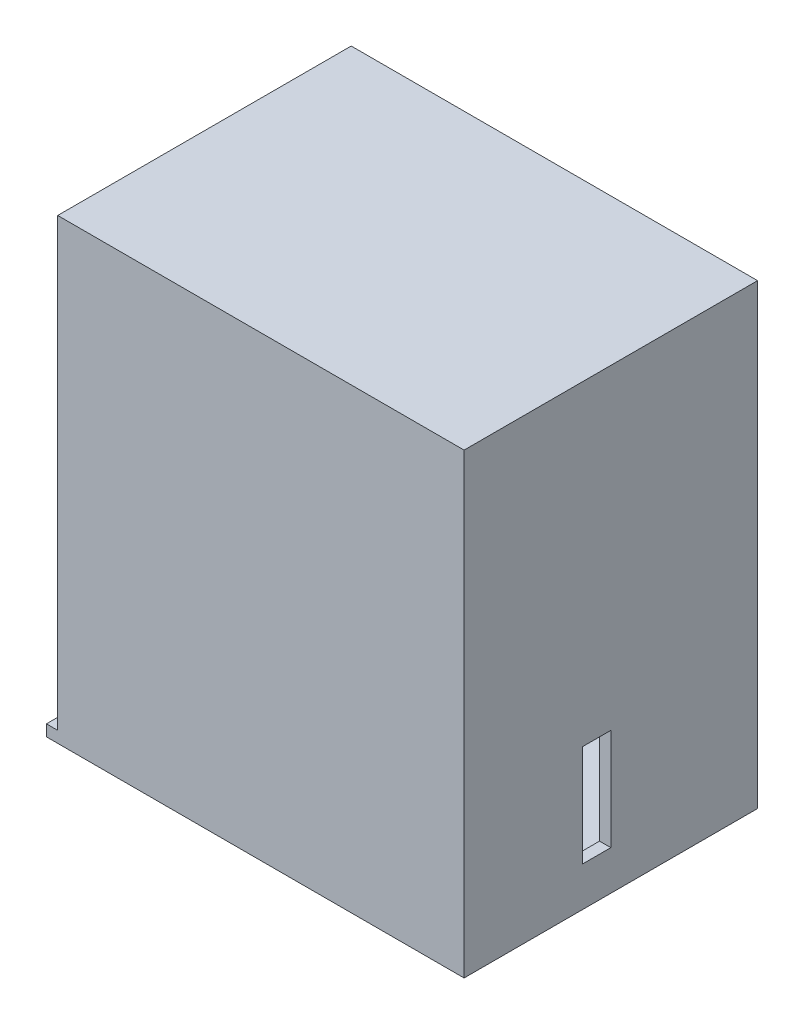
ISO-10303-21;
HEADER;
FILE_DESCRIPTION(('STEP AP214'),'2;1');
FILE_NAME('part.step','',(''),(''),'','','');
FILE_SCHEMA(('AUTOMOTIVE_DESIGN { 1 0 10303 214 1 1 1 1 }'));
ENDSEC;
DATA;
#1=APPLICATION_CONTEXT('core data for automotive mechanical design processes');
#2=APPLICATION_PROTOCOL_DEFINITION('international standard','automotive_design',2000,#1);
#3=PRODUCT_CONTEXT('',#1,'mechanical');
#4=PRODUCT('Part','Part','',(#3));
#5=PRODUCT_RELATED_PRODUCT_CATEGORY('part','',(#4));
#6=PRODUCT_DEFINITION_FORMATION('','',#4);
#7=PRODUCT_DEFINITION_CONTEXT('part definition',#1,'design');
#8=PRODUCT_DEFINITION('design','',#6,#7);
#9=PRODUCT_DEFINITION_SHAPE('','',#8);
#10=(LENGTH_UNIT() NAMED_UNIT(*) SI_UNIT(.MILLI.,.METRE.));
#11=(NAMED_UNIT(*) PLANE_ANGLE_UNIT() SI_UNIT($,.RADIAN.));
#12=(NAMED_UNIT(*) SI_UNIT($,.STERADIAN.) SOLID_ANGLE_UNIT());
#13=UNCERTAINTY_MEASURE_WITH_UNIT(LENGTH_MEASURE(1.E-05),#10,'distance_accuracy_value','');
#14=(GEOMETRIC_REPRESENTATION_CONTEXT(3) GLOBAL_UNCERTAINTY_ASSIGNED_CONTEXT((#13)) GLOBAL_UNIT_ASSIGNED_CONTEXT((#10,
#11,#12)) REPRESENTATION_CONTEXT('',''));
#15=CARTESIAN_POINT('',(0.,0.,0.));
#16=DIRECTION('',(0.,0.,1.));
#17=DIRECTION('',(1.,0.,0.));
#18=AXIS2_PLACEMENT_3D('',#15,#16,#17);
#19=CARTESIAN_POINT('',(-79.4466637243918,4.20962199312715,2.));
#20=DIRECTION('',(1.,0.,0.));
#21=DIRECTION('',(0.,1.,0.));
#22=AXIS2_PLACEMENT_3D('',#19,#20,#21);
#23=PLANE('',#22);
#24=DIRECTION('',(0.,-1.,0.));
#25=VECTOR('',#24,1.);
#26=CARTESIAN_POINT('',(-79.4466637243918,4.20962199312715,0.));
#27=LINE('',#26,#25);
#28=CARTESIAN_POINT('',(-79.4466637243918,4.20962199312715,0.));
#29=VERTEX_POINT('',#28);
#30=CARTESIAN_POINT('',(-79.4466637243918,-72.7903780068729,0.));
#31=VERTEX_POINT('',#30);
#32=EDGE_CURVE('E59',#29,#31,#27,.T.);
#33=ORIENTED_EDGE('',*,*,#32,.T.);
#34=DIRECTION('',(0.,0.,-1.));
#35=VECTOR('',#34,1.);
#36=CARTESIAN_POINT('',(-79.4466637243918,-72.7903780068729,2.));
#37=LINE('',#36,#35);
#38=CARTESIAN_POINT('',(-79.4466637243918,-72.7903780068729,2.));
#39=VERTEX_POINT('',#38);
#40=EDGE_CURVE('E11',#39,#31,#37,.T.);
#41=ORIENTED_EDGE('',*,*,#40,.F.);
#42=DIRECTION('',(0.,-1.,0.));
#43=VECTOR('',#42,1.);
#44=CARTESIAN_POINT('',(-79.4466637243918,4.20962199312715,2.));
#45=LINE('',#44,#43);
#46=CARTESIAN_POINT('',(-79.4466637243918,6.20962199312715,2.));
#47=VERTEX_POINT('',#46);
#48=EDGE_CURVE('E41',#47,#39,#45,.T.);
#49=ORIENTED_EDGE('',*,*,#48,.F.);
#50=DIRECTION('',(0.,0.,1.));
#51=VECTOR('',#50,1.);
#52=CARTESIAN_POINT('',(-79.4466637243918,6.20962199312715,2.));
#53=LINE('',#52,#51);
#54=CARTESIAN_POINT('',(-79.4466637243918,6.20962199312715,-50.));
#55=VERTEX_POINT('',#54);
#56=EDGE_CURVE('E162',#55,#47,#53,.T.);
#57=ORIENTED_EDGE('',*,*,#56,.F.);
#58=DIRECTION('',(0.,-1.,0.));
#59=VECTOR('',#58,1.);
#60=CARTESIAN_POINT('',(-79.4466637243918,6.20962199312715,-50.));
#61=LINE('',#60,#59);
#62=CARTESIAN_POINT('',(-79.4466637243918,4.20962199312715,-50.));
#63=VERTEX_POINT('',#62);
#64=EDGE_CURVE('E187',#55,#63,#61,.T.);
#65=ORIENTED_EDGE('',*,*,#64,.T.);
#66=DIRECTION('',(0.,0.,1.));
#67=VECTOR('',#66,1.);
#68=CARTESIAN_POINT('',(-79.4466637243918,4.20962199312715,2.));
#69=LINE('',#68,#67);
#70=EDGE_CURVE('E182',#63,#29,#69,.T.);
#71=ORIENTED_EDGE('',*,*,#70,.T.);
#72=EDGE_LOOP('',(#33,#41,#49,#57,#65,#71));
#73=FACE_BOUND('',#72,.T.);
#74=ADVANCED_FACE('F33',(#73),#23,.F.);
#75=CARTESIAN_POINT('',(0.,0.,2.));
#76=DIRECTION('',(0.,0.,-1.));
#77=DIRECTION('',(-1.,0.,0.));
#78=AXIS2_PLACEMENT_3D('',#75,#76,#77);
#79=PLANE('',#78);
#80=ORIENTED_EDGE('',*,*,#48,.T.);
#81=DIRECTION('',(-1.,0.,0.));
#82=VECTOR('',#81,1.);
#83=CARTESIAN_POINT('',(-7.4466637243918,-72.7903780068729,2.));
#84=LINE('',#83,#82);
#85=CARTESIAN_POINT('',(-81.4466637243918,-72.7903780068729,1.99999999999999));
#86=VERTEX_POINT('',#85);
#87=EDGE_CURVE('E222',#39,#86,#84,.T.);
#88=ORIENTED_EDGE('',*,*,#87,.T.);
#89=DIRECTION('',(0.,1.,0.));
#90=VECTOR('',#89,1.);
#91=CARTESIAN_POINT('',(-81.4466637243918,-74.7903780068729,1.99999999999999));
#92=LINE('',#91,#90);
#93=CARTESIAN_POINT('',(-81.4466637243918,-74.7903780068729,1.99999999999999));
#94=VERTEX_POINT('',#93);
#95=EDGE_CURVE('E242',#94,#86,#92,.T.);
#96=ORIENTED_EDGE('',*,*,#95,.F.);
#97=DIRECTION('',(-1.,0.,0.));
#98=VECTOR('',#97,1.);
#99=CARTESIAN_POINT('',(-7.4466637243918,-74.7903780068729,2.));
#100=LINE('',#99,#98);
#101=CARTESIAN_POINT('',(-7.4466637243918,-74.7903780068729,2.));
#102=VERTEX_POINT('',#101);
#103=EDGE_CURVE('E226',#102,#94,#100,.T.);
#104=ORIENTED_EDGE('',*,*,#103,.F.);
#105=DIRECTION('',(0.,-1.,0.));
#106=VECTOR('',#105,1.);
#107=CARTESIAN_POINT('',(-7.44666372439181,4.20962199312715,2.));
#108=LINE('',#107,#106);
#109=CARTESIAN_POINT('',(-7.44666372439181,6.20962199312715,2.));
#110=VERTEX_POINT('',#109);
#111=EDGE_CURVE('E170',#110,#102,#108,.T.);
#112=ORIENTED_EDGE('',*,*,#111,.F.);
#113=DIRECTION('',(1.,0.,0.));
#114=VECTOR('',#113,1.);
#115=CARTESIAN_POINT('',(-79.4466637243918,6.20962199312715,2.));
#116=LINE('',#115,#114);
#117=EDGE_CURVE('E167',#47,#110,#116,.T.);
#118=ORIENTED_EDGE('',*,*,#117,.F.);
#119=EDGE_LOOP('',(#80,#88,#96,#104,#112,#118));
#120=FACE_BOUND('',#119,.T.);
#121=ADVANCED_FACE('F168',(#120),#79,.F.);
#122=CARTESIAN_POINT('',(0.,0.,0.));
#123=DIRECTION('',(0.,0.,-1.));
#124=DIRECTION('',(-1.,0.,0.));
#125=AXIS2_PLACEMENT_3D('',#122,#123,#124);
#126=PLANE('',#125);
#127=DIRECTION('',(0.,1.,0.));
#128=VECTOR('',#127,1.);
#129=CARTESIAN_POINT('',(-9.44666372439181,4.20962199312715,0.));
#130=LINE('',#129,#128);
#131=CARTESIAN_POINT('',(-9.4466637243918,-72.7903780068729,0.));
#132=VERTEX_POINT('',#131);
#133=CARTESIAN_POINT('',(-9.44666372439181,4.20962199312715,0.));
#134=VERTEX_POINT('',#133);
#135=EDGE_CURVE('E275',#132,#134,#130,.T.);
#136=ORIENTED_EDGE('',*,*,#135,.F.);
#137=DIRECTION('',(1.,0.,0.));
#138=VECTOR('',#137,1.);
#139=CARTESIAN_POINT('',(-9.4466637243918,-72.7903780068729,0.));
#140=LINE('',#139,#138);
#141=EDGE_CURVE('E164',#31,#132,#140,.T.);
#142=ORIENTED_EDGE('',*,*,#141,.F.);
#143=ORIENTED_EDGE('',*,*,#32,.F.);
#144=DIRECTION('',(-1.,0.,0.));
#145=VECTOR('',#144,1.);
#146=CARTESIAN_POINT('',(-9.44666372439181,4.20962199312715,0.));
#147=LINE('',#146,#145);
#148=EDGE_CURVE('E283',#134,#29,#147,.T.);
#149=ORIENTED_EDGE('',*,*,#148,.F.);
#150=EDGE_LOOP('',(#136,#142,#143,#149));
#151=FACE_BOUND('',#150,.T.);
#152=ADVANCED_FACE('F290',(#151),#126,.T.);
#153=CARTESIAN_POINT('',(-9.44666372439181,0.,0.));
#154=DIRECTION('',(1.,0.,0.));
#155=DIRECTION('',(0.,1.,0.));
#156=AXIS2_PLACEMENT_3D('',#153,#154,#155);
#157=PLANE('',#156);
#158=DIRECTION('',(0.,1.,0.));
#159=VECTOR('',#158,1.);
#160=CARTESIAN_POINT('',(-9.4466637243918,-67.7903780068728,-24.));
#161=LINE('',#160,#159);
#162=CARTESIAN_POINT('',(-9.4466637243918,-67.7903780068728,-24.));
#163=VERTEX_POINT('',#162);
#164=CARTESIAN_POINT('',(-9.4466637243918,-49.7903780068728,-24.));
#165=VERTEX_POINT('',#164);
#166=EDGE_CURVE('E75',#163,#165,#161,.T.);
#167=ORIENTED_EDGE('',*,*,#166,.T.);
#168=DIRECTION('',(0.,0.,1.));
#169=VECTOR('',#168,1.);
#170=CARTESIAN_POINT('',(-9.4466637243918,-49.7903780068728,-24.));
#171=LINE('',#170,#169);
#172=CARTESIAN_POINT('',(-9.4466637243918,-49.7903780068728,-19.));
#173=VERTEX_POINT('',#172);
#174=EDGE_CURVE('E256',#165,#173,#171,.T.);
#175=ORIENTED_EDGE('',*,*,#174,.T.);
#176=DIRECTION('',(0.,-1.,0.));
#177=VECTOR('',#176,1.);
#178=CARTESIAN_POINT('',(-9.4466637243918,-67.7903780068728,-19.));
#179=LINE('',#178,#177);
#180=CARTESIAN_POINT('',(-9.4466637243918,-67.7903780068728,-19.));
#181=VERTEX_POINT('',#180);
#182=EDGE_CURVE('E259',#173,#181,#179,.T.);
#183=ORIENTED_EDGE('',*,*,#182,.T.);
#184=DIRECTION('',(0.,0.,-1.));
#185=VECTOR('',#184,1.);
#186=CARTESIAN_POINT('',(-9.4466637243918,-67.7903780068728,-24.));
#187=LINE('',#186,#185);
#188=EDGE_CURVE('E248',#181,#163,#187,.T.);
#189=ORIENTED_EDGE('',*,*,#188,.T.);
#190=EDGE_LOOP('',(#167,#175,#183,#189));
#191=FACE_BOUND('',#190,.T.);
#192=DIRECTION('',(0.,0.,-1.));
#193=VECTOR('',#192,1.);
#194=CARTESIAN_POINT('',(-9.4466637243918,-72.7903780068729,2.));
#195=LINE('',#194,#193);
#196=CARTESIAN_POINT('',(-9.4466637243918,-72.7903780068729,-50.));
#197=VERTEX_POINT('',#196);
#198=EDGE_CURVE('E270',#132,#197,#195,.T.);
#199=ORIENTED_EDGE('',*,*,#198,.F.);
#200=ORIENTED_EDGE('',*,*,#135,.T.);
#201=DIRECTION('',(0.,0.,1.));
#202=VECTOR('',#201,1.);
#203=CARTESIAN_POINT('',(-9.44666372439181,4.20962199312715,2.));
#204=LINE('',#203,#202);
#205=CARTESIAN_POINT('',(-9.44666372439181,4.20962199312715,-50.));
#206=VERTEX_POINT('',#205);
#207=EDGE_CURVE('E273',#206,#134,#204,.T.);
#208=ORIENTED_EDGE('',*,*,#207,.F.);
#209=DIRECTION('',(0.,1.,0.));
#210=VECTOR('',#209,1.);
#211=CARTESIAN_POINT('',(-9.44666372439181,4.20962199312715,-50.));
#212=LINE('',#211,#210);
#213=EDGE_CURVE('E278',#197,#206,#212,.T.);
#214=ORIENTED_EDGE('',*,*,#213,.F.);
#215=EDGE_LOOP('',(#199,#200,#208,#214));
#216=FACE_BOUND('',#215,.T.);
#217=ADVANCED_FACE('F297',(#191,#216),#157,.F.);
#218=CARTESIAN_POINT('',(-7.44666372439181,0.,0.));
#219=DIRECTION('',(1.,0.,0.));
#220=DIRECTION('',(0.,1.,0.));
#221=AXIS2_PLACEMENT_3D('',#218,#219,#220);
#222=PLANE('',#221);
#223=ORIENTED_EDGE('',*,*,#111,.T.);
#224=DIRECTION('',(0.,0.,1.));
#225=VECTOR('',#224,1.);
#226=CARTESIAN_POINT('',(-7.4466637243918,-74.7903780068729,-50.));
#227=LINE('',#226,#225);
#228=CARTESIAN_POINT('',(-7.4466637243918,-74.7903780068729,-50.));
#229=VERTEX_POINT('',#228);
#230=EDGE_CURVE('E223',#229,#102,#227,.T.);
#231=ORIENTED_EDGE('',*,*,#230,.F.);
#232=DIRECTION('',(0.,1.,0.));
#233=VECTOR('',#232,1.);
#234=CARTESIAN_POINT('',(-7.44666372439181,4.20962199312715,-50.));
#235=LINE('',#234,#233);
#236=CARTESIAN_POINT('',(-7.44666372439181,6.20962199312715,-50.));
#237=VERTEX_POINT('',#236);
#238=EDGE_CURVE('E272',#229,#237,#235,.T.);
#239=ORIENTED_EDGE('',*,*,#238,.T.);
#240=DIRECTION('',(0.,0.,-1.));
#241=VECTOR('',#240,1.);
#242=CARTESIAN_POINT('',(-7.44666372439181,6.20962199312715,2.));
#243=LINE('',#242,#241);
#244=EDGE_CURVE('E174',#110,#237,#243,.T.);
#245=ORIENTED_EDGE('',*,*,#244,.F.);
#246=EDGE_LOOP('',(#223,#231,#239,#245));
#247=FACE_BOUND('',#246,.T.);
#248=DIRECTION('',(0.,0.,1.));
#249=VECTOR('',#248,1.);
#250=CARTESIAN_POINT('',(-7.4466637243918,-49.7903780068728,-24.));
#251=LINE('',#250,#249);
#252=CARTESIAN_POINT('',(-7.4466637243918,-49.7903780068728,-24.));
#253=VERTEX_POINT('',#252);
#254=CARTESIAN_POINT('',(-7.4466637243918,-49.7903780068728,-19.));
#255=VERTEX_POINT('',#254);
#256=EDGE_CURVE('E247',#253,#255,#251,.T.);
#257=ORIENTED_EDGE('',*,*,#256,.F.);
#258=DIRECTION('',(0.,1.,0.));
#259=VECTOR('',#258,1.);
#260=CARTESIAN_POINT('',(-7.4466637243918,-67.7903780068728,-24.));
#261=LINE('',#260,#259);
#262=CARTESIAN_POINT('',(-7.4466637243918,-67.7903780068728,-24.));
#263=VERTEX_POINT('',#262);
#264=EDGE_CURVE('E245',#263,#253,#261,.T.);
#265=ORIENTED_EDGE('',*,*,#264,.F.);
#266=DIRECTION('',(0.,0.,-1.));
#267=VECTOR('',#266,1.);
#268=CARTESIAN_POINT('',(-7.4466637243918,-67.7903780068728,-24.));
#269=LINE('',#268,#267);
#270=CARTESIAN_POINT('',(-7.4466637243918,-67.7903780068728,-19.));
#271=VERTEX_POINT('',#270);
#272=EDGE_CURVE('E252',#271,#263,#269,.T.);
#273=ORIENTED_EDGE('',*,*,#272,.F.);
#274=DIRECTION('',(0.,-1.,0.));
#275=VECTOR('',#274,1.);
#276=CARTESIAN_POINT('',(-7.4466637243918,-67.7903780068728,-19.));
#277=LINE('',#276,#275);
#278=EDGE_CURVE('E250',#255,#271,#277,.T.);
#279=ORIENTED_EDGE('',*,*,#278,.F.);
#280=EDGE_LOOP('',(#257,#265,#273,#279));
#281=FACE_BOUND('',#280,.T.);
#282=ADVANCED_FACE('F312',(#247,#281),#222,.T.);
#283=CARTESIAN_POINT('',(-7.44666372439181,4.20962199312715,-50.));
#284=DIRECTION('',(0.,0.,1.));
#285=DIRECTION('',(1.,0.,0.));
#286=AXIS2_PLACEMENT_3D('',#283,#284,#285);
#287=PLANE('',#286);
#288=ORIENTED_EDGE('',*,*,#213,.T.);
#289=DIRECTION('',(-1.,0.,0.));
#290=VECTOR('',#289,1.);
#291=CARTESIAN_POINT('',(-79.4466637243918,4.20962199312715,-50.));
#292=LINE('',#291,#290);
#293=EDGE_CURVE('E180',#206,#63,#292,.T.);
#294=ORIENTED_EDGE('',*,*,#293,.T.);
#295=ORIENTED_EDGE('',*,*,#64,.F.);
#296=DIRECTION('',(-1.,0.,0.));
#297=VECTOR('',#296,1.);
#298=CARTESIAN_POINT('',(-79.4466637243918,6.20962199312715,-50.));
#299=LINE('',#298,#297);
#300=EDGE_CURVE('E178',#237,#55,#299,.T.);
#301=ORIENTED_EDGE('',*,*,#300,.F.);
#302=ORIENTED_EDGE('',*,*,#238,.F.);
#303=DIRECTION('',(1.,0.,0.));
#304=VECTOR('',#303,1.);
#305=CARTESIAN_POINT('',(-7.4466637243918,-74.7903780068729,-50.));
#306=LINE('',#305,#304);
#307=CARTESIAN_POINT('',(-81.4466637243918,-74.7903780068729,-50.));
#308=VERTEX_POINT('',#307);
#309=EDGE_CURVE('E231',#308,#229,#306,.T.);
#310=ORIENTED_EDGE('',*,*,#309,.F.);
#311=DIRECTION('',(0.,1.,0.));
#312=VECTOR('',#311,1.);
#313=CARTESIAN_POINT('',(-81.4466637243918,-74.7903780068729,-50.));
#314=LINE('',#313,#312);
#315=CARTESIAN_POINT('',(-81.4466637243918,-72.7903780068729,-50.));
#316=VERTEX_POINT('',#315);
#317=EDGE_CURVE('E234',#308,#316,#314,.T.);
#318=ORIENTED_EDGE('',*,*,#317,.T.);
#319=DIRECTION('',(1.,0.,0.));
#320=VECTOR('',#319,1.);
#321=CARTESIAN_POINT('',(-7.4466637243918,-72.7903780068729,-50.));
#322=LINE('',#321,#320);
#323=EDGE_CURVE('E227',#316,#197,#322,.T.);
#324=ORIENTED_EDGE('',*,*,#323,.T.);
#325=EDGE_LOOP('',(#288,#294,#295,#301,#302,#310,#318,#324));
#326=FACE_BOUND('',#325,.T.);
#327=ADVANCED_FACE('F299',(#326),#287,.F.);
#328=CARTESIAN_POINT('',(-7.4466637243918,-67.7903780068728,-24.));
#329=DIRECTION('',(0.,0.,1.));
#330=DIRECTION('',(1.,0.,0.));
#331=AXIS2_PLACEMENT_3D('',#328,#329,#330);
#332=PLANE('',#331);
#333=ORIENTED_EDGE('',*,*,#166,.F.);
#334=DIRECTION('',(-1.,0.,0.));
#335=VECTOR('',#334,1.);
#336=CARTESIAN_POINT('',(-7.4466637243918,-67.7903780068728,-24.));
#337=LINE('',#336,#335);
#338=EDGE_CURVE('E254',#263,#163,#337,.T.);
#339=ORIENTED_EDGE('',*,*,#338,.F.);
#340=ORIENTED_EDGE('',*,*,#264,.T.);
#341=DIRECTION('',(-1.,0.,0.));
#342=VECTOR('',#341,1.);
#343=CARTESIAN_POINT('',(-7.4466637243918,-49.7903780068728,-24.));
#344=LINE('',#343,#342);
#345=EDGE_CURVE('E268',#253,#165,#344,.T.);
#346=ORIENTED_EDGE('',*,*,#345,.T.);
#347=EDGE_LOOP('',(#333,#339,#340,#346));
#348=FACE_BOUND('',#347,.T.);
#349=ADVANCED_FACE('F328',(#348),#332,.T.);
#350=CARTESIAN_POINT('',(-7.4466637243918,-49.7903780068728,-24.));
#351=DIRECTION('',(0.,-1.,0.));
#352=DIRECTION('',(1.,0.,0.));
#353=AXIS2_PLACEMENT_3D('',#350,#351,#352);
#354=PLANE('',#353);
#355=ORIENTED_EDGE('',*,*,#174,.F.);
#356=ORIENTED_EDGE('',*,*,#345,.F.);
#357=ORIENTED_EDGE('',*,*,#256,.T.);
#358=DIRECTION('',(-1.,0.,0.));
#359=VECTOR('',#358,1.);
#360=CARTESIAN_POINT('',(-7.4466637243918,-49.7903780068728,-19.));
#361=LINE('',#360,#359);
#362=EDGE_CURVE('E266',#255,#173,#361,.T.);
#363=ORIENTED_EDGE('',*,*,#362,.T.);
#364=EDGE_LOOP('',(#355,#356,#357,#363));
#365=FACE_BOUND('',#364,.T.);
#366=ADVANCED_FACE('F323',(#365),#354,.T.);
#367=CARTESIAN_POINT('',(-7.4466637243918,-67.7903780068728,-19.));
#368=DIRECTION('',(0.,0.,-1.));
#369=DIRECTION('',(-1.,0.,0.));
#370=AXIS2_PLACEMENT_3D('',#367,#368,#369);
#371=PLANE('',#370);
#372=ORIENTED_EDGE('',*,*,#182,.F.);
#373=ORIENTED_EDGE('',*,*,#362,.F.);
#374=ORIENTED_EDGE('',*,*,#278,.T.);
#375=DIRECTION('',(-1.,0.,0.));
#376=VECTOR('',#375,1.);
#377=CARTESIAN_POINT('',(-7.4466637243918,-67.7903780068728,-19.));
#378=LINE('',#377,#376);
#379=EDGE_CURVE('E67',#271,#181,#378,.T.);
#380=ORIENTED_EDGE('',*,*,#379,.T.);
#381=EDGE_LOOP('',(#372,#373,#374,#380));
#382=FACE_BOUND('',#381,.T.);
#383=ADVANCED_FACE('F326',(#382),#371,.T.);
#384=CARTESIAN_POINT('',(-7.4466637243918,-67.7903780068728,-24.));
#385=DIRECTION('',(0.,1.,0.));
#386=DIRECTION('',(-1.,0.,0.));
#387=AXIS2_PLACEMENT_3D('',#384,#385,#386);
#388=PLANE('',#387);
#389=ORIENTED_EDGE('',*,*,#188,.F.);
#390=ORIENTED_EDGE('',*,*,#379,.F.);
#391=ORIENTED_EDGE('',*,*,#272,.T.);
#392=ORIENTED_EDGE('',*,*,#338,.T.);
#393=EDGE_LOOP('',(#389,#390,#391,#392));
#394=FACE_BOUND('',#393,.T.);
#395=ADVANCED_FACE('F329',(#394),#388,.T.);
#396=CARTESIAN_POINT('',(0.,-72.7903780068729,0.));
#397=DIRECTION('',(0.,-1.,0.));
#398=DIRECTION('',(1.,0.,0.));
#399=AXIS2_PLACEMENT_3D('',#396,#397,#398);
#400=PLANE('',#399);
#401=DIRECTION('',(0.,0.,1.));
#402=VECTOR('',#401,1.);
#403=CARTESIAN_POINT('',(-45.3978128792458,-72.7903780068729,-35.));
#404=LINE('',#403,#402);
#405=CARTESIAN_POINT('',(-45.3978128792458,-72.7903780068729,-35.));
#406=VERTEX_POINT('',#405);
#407=CARTESIAN_POINT('',(-45.3978128792458,-72.7903780068729,-29.));
#408=VERTEX_POINT('',#407);
#409=EDGE_CURVE('E191',#406,#408,#404,.T.);
#410=ORIENTED_EDGE('',*,*,#409,.T.);
#411=DIRECTION('',(-1.,0.,0.));
#412=VECTOR('',#411,1.);
#413=CARTESIAN_POINT('',(-45.3978128792458,-72.7903780068729,-29.));
#414=LINE('',#413,#412);
#415=CARTESIAN_POINT('',(-73.3978128792458,-72.7903780068729,-29.));
#416=VERTEX_POINT('',#415);
#417=EDGE_CURVE('E205',#408,#416,#414,.T.);
#418=ORIENTED_EDGE('',*,*,#417,.T.);
#419=DIRECTION('',(0.,0.,-1.));
#420=VECTOR('',#419,1.);
#421=CARTESIAN_POINT('',(-73.3978128792458,-72.7903780068729,-29.));
#422=LINE('',#421,#420);
#423=CARTESIAN_POINT('',(-73.3978128792458,-72.7903780068729,-35.));
#424=VERTEX_POINT('',#423);
#425=EDGE_CURVE('E208',#416,#424,#422,.T.);
#426=ORIENTED_EDGE('',*,*,#425,.T.);
#427=DIRECTION('',(1.,0.,0.));
#428=VECTOR('',#427,1.);
#429=CARTESIAN_POINT('',(-45.3978128792458,-72.7903780068729,-35.));
#430=LINE('',#429,#428);
#431=EDGE_CURVE('E195',#424,#406,#430,.T.);
#432=ORIENTED_EDGE('',*,*,#431,.T.);
#433=EDGE_LOOP('',(#410,#418,#426,#432));
#434=FACE_BOUND('',#433,.T.);
#435=ORIENTED_EDGE('',*,*,#141,.T.);
#436=ORIENTED_EDGE('',*,*,#198,.T.);
#437=ORIENTED_EDGE('',*,*,#323,.F.);
#438=DIRECTION('',(0.,0.,-1.));
#439=VECTOR('',#438,1.);
#440=CARTESIAN_POINT('',(-81.4466637243918,-72.7903780068729,-50.));
#441=LINE('',#440,#439);
#442=EDGE_CURVE('E236',#86,#316,#441,.T.);
#443=ORIENTED_EDGE('',*,*,#442,.F.);
#444=ORIENTED_EDGE('',*,*,#87,.F.);
#445=ORIENTED_EDGE('',*,*,#40,.T.);
#446=EDGE_LOOP('',(#435,#436,#437,#443,#444,#445));
#447=FACE_BOUND('',#446,.T.);
#448=ADVANCED_FACE('F287',(#434,#447),#400,.F.);
#449=CARTESIAN_POINT('',(0.,-74.7903780068729,0.));
#450=DIRECTION('',(0.,-1.,0.));
#451=DIRECTION('',(1.,0.,0.));
#452=AXIS2_PLACEMENT_3D('',#449,#450,#451);
#453=PLANE('',#452);
#454=ORIENTED_EDGE('',*,*,#230,.T.);
#455=ORIENTED_EDGE('',*,*,#103,.T.);
#456=DIRECTION('',(0.,0.,-1.));
#457=VECTOR('',#456,1.);
#458=CARTESIAN_POINT('',(-81.4466637243918,-74.7903780068729,-50.));
#459=LINE('',#458,#457);
#460=EDGE_CURVE('E229',#94,#308,#459,.T.);
#461=ORIENTED_EDGE('',*,*,#460,.T.);
#462=ORIENTED_EDGE('',*,*,#309,.T.);
#463=EDGE_LOOP('',(#454,#455,#461,#462));
#464=FACE_BOUND('',#463,.T.);
#465=DIRECTION('',(-1.,0.,0.));
#466=VECTOR('',#465,1.);
#467=CARTESIAN_POINT('',(-45.3978128792458,-74.7903780068729,-29.));
#468=LINE('',#467,#466);
#469=CARTESIAN_POINT('',(-45.3978128792458,-74.7903780068729,-29.));
#470=VERTEX_POINT('',#469);
#471=CARTESIAN_POINT('',(-73.3978128792458,-74.7903780068729,-29.));
#472=VERTEX_POINT('',#471);
#473=EDGE_CURVE('E194',#470,#472,#468,.T.);
#474=ORIENTED_EDGE('',*,*,#473,.F.);
#475=DIRECTION('',(0.,0.,1.));
#476=VECTOR('',#475,1.);
#477=CARTESIAN_POINT('',(-45.3978128792458,-74.7903780068729,-35.));
#478=LINE('',#477,#476);
#479=CARTESIAN_POINT('',(-45.3978128792458,-74.7903780068729,-35.));
#480=VERTEX_POINT('',#479);
#481=EDGE_CURVE('E192',#480,#470,#478,.T.);
#482=ORIENTED_EDGE('',*,*,#481,.F.);
#483=DIRECTION('',(1.,0.,0.));
#484=VECTOR('',#483,1.);
#485=CARTESIAN_POINT('',(-45.3978128792458,-74.7903780068729,-35.));
#486=LINE('',#485,#484);
#487=CARTESIAN_POINT('',(-73.3978128792458,-74.7903780068729,-35.));
#488=VERTEX_POINT('',#487);
#489=EDGE_CURVE('E200',#488,#480,#486,.T.);
#490=ORIENTED_EDGE('',*,*,#489,.F.);
#491=DIRECTION('',(0.,0.,-1.));
#492=VECTOR('',#491,1.);
#493=CARTESIAN_POINT('',(-73.3978128792458,-74.7903780068729,-29.));
#494=LINE('',#493,#492);
#495=EDGE_CURVE('E197',#472,#488,#494,.T.);
#496=ORIENTED_EDGE('',*,*,#495,.F.);
#497=EDGE_LOOP('',(#474,#482,#490,#496));
#498=FACE_BOUND('',#497,.T.);
#499=ADVANCED_FACE('F309',(#464,#498),#453,.T.);
#500=CARTESIAN_POINT('',(-81.4466637243918,-74.7903780068729,-50.));
#501=DIRECTION('',(1.,0.,0.));
#502=DIRECTION('',(0.,1.,0.));
#503=AXIS2_PLACEMENT_3D('',#500,#501,#502);
#504=PLANE('',#503);
#505=ORIENTED_EDGE('',*,*,#442,.T.);
#506=ORIENTED_EDGE('',*,*,#317,.F.);
#507=ORIENTED_EDGE('',*,*,#460,.F.);
#508=ORIENTED_EDGE('',*,*,#95,.T.);
#509=EDGE_LOOP('',(#505,#506,#507,#508));
#510=FACE_BOUND('',#509,.T.);
#511=ADVANCED_FACE('F304',(#510),#504,.F.);
#512=CARTESIAN_POINT('',(-45.3978128792458,-74.7903780068729,-35.));
#513=DIRECTION('',(-1.,0.,0.));
#514=DIRECTION('',(0.,-1.,0.));
#515=AXIS2_PLACEMENT_3D('',#512,#513,#514);
#516=PLANE('',#515);
#517=ORIENTED_EDGE('',*,*,#409,.F.);
#518=DIRECTION('',(0.,1.,0.));
#519=VECTOR('',#518,1.);
#520=CARTESIAN_POINT('',(-45.3978128792458,-74.7903780068729,-35.));
#521=LINE('',#520,#519);
#522=EDGE_CURVE('E202',#480,#406,#521,.T.);
#523=ORIENTED_EDGE('',*,*,#522,.F.);
#524=ORIENTED_EDGE('',*,*,#481,.T.);
#525=DIRECTION('',(0.,1.,0.));
#526=VECTOR('',#525,1.);
#527=CARTESIAN_POINT('',(-45.3978128792458,-74.7903780068729,-29.));
#528=LINE('',#527,#526);
#529=EDGE_CURVE('E219',#470,#408,#528,.T.);
#530=ORIENTED_EDGE('',*,*,#529,.T.);
#531=EDGE_LOOP('',(#517,#523,#524,#530));
#532=FACE_BOUND('',#531,.T.);
#533=ADVANCED_FACE('F393',(#532),#516,.T.);
#534=CARTESIAN_POINT('',(-45.3978128792458,-74.7903780068729,-29.));
#535=DIRECTION('',(0.,0.,-1.));
#536=DIRECTION('',(-1.,0.,0.));
#537=AXIS2_PLACEMENT_3D('',#534,#535,#536);
#538=PLANE('',#537);
#539=ORIENTED_EDGE('',*,*,#417,.F.);
#540=ORIENTED_EDGE('',*,*,#529,.F.);
#541=ORIENTED_EDGE('',*,*,#473,.T.);
#542=DIRECTION('',(0.,1.,0.));
#543=VECTOR('',#542,1.);
#544=CARTESIAN_POINT('',(-73.3978128792458,-74.7903780068729,-29.));
#545=LINE('',#544,#543);
#546=EDGE_CURVE('E217',#472,#416,#545,.T.);
#547=ORIENTED_EDGE('',*,*,#546,.T.);
#548=EDGE_LOOP('',(#539,#540,#541,#547));
#549=FACE_BOUND('',#548,.T.);
#550=ADVANCED_FACE('F401',(#549),#538,.T.);
#551=CARTESIAN_POINT('',(-73.3978128792458,-74.7903780068729,-29.));
#552=DIRECTION('',(1.,0.,0.));
#553=DIRECTION('',(0.,1.,0.));
#554=AXIS2_PLACEMENT_3D('',#551,#552,#553);
#555=PLANE('',#554);
#556=ORIENTED_EDGE('',*,*,#425,.F.);
#557=ORIENTED_EDGE('',*,*,#546,.F.);
#558=ORIENTED_EDGE('',*,*,#495,.T.);
#559=DIRECTION('',(0.,1.,0.));
#560=VECTOR('',#559,1.);
#561=CARTESIAN_POINT('',(-73.3978128792458,-74.7903780068729,-35.));
#562=LINE('',#561,#560);
#563=EDGE_CURVE('E215',#488,#424,#562,.T.);
#564=ORIENTED_EDGE('',*,*,#563,.T.);
#565=EDGE_LOOP('',(#556,#557,#558,#564));
#566=FACE_BOUND('',#565,.T.);
#567=ADVANCED_FACE('F411',(#566),#555,.T.);
#568=CARTESIAN_POINT('',(-45.3978128792458,-74.7903780068729,-35.));
#569=DIRECTION('',(0.,0.,1.));
#570=DIRECTION('',(1.,0.,0.));
#571=AXIS2_PLACEMENT_3D('',#568,#569,#570);
#572=PLANE('',#571);
#573=ORIENTED_EDGE('',*,*,#431,.F.);
#574=ORIENTED_EDGE('',*,*,#563,.F.);
#575=ORIENTED_EDGE('',*,*,#489,.T.);
#576=ORIENTED_EDGE('',*,*,#522,.T.);
#577=EDGE_LOOP('',(#573,#574,#575,#576));
#578=FACE_BOUND('',#577,.T.);
#579=ADVANCED_FACE('F421',(#578),#572,.T.);
#580=CARTESIAN_POINT('',(0.,6.20962199312715,0.));
#581=DIRECTION('',(0.,-1.,0.));
#582=DIRECTION('',(0.,0.,-1.));
#583=AXIS2_PLACEMENT_3D('',#580,#581,#582);
#584=PLANE('',#583);
#585=ORIENTED_EDGE('',*,*,#56,.T.);
#586=ORIENTED_EDGE('',*,*,#117,.T.);
#587=ORIENTED_EDGE('',*,*,#244,.T.);
#588=ORIENTED_EDGE('',*,*,#300,.T.);
#589=EDGE_LOOP('',(#585,#586,#587,#588));
#590=FACE_BOUND('',#589,.T.);
#591=ADVANCED_FACE('F176',(#590),#584,.F.);
#592=CARTESIAN_POINT('',(0.,4.20962199312715,0.));
#593=DIRECTION('',(0.,-1.,0.));
#594=DIRECTION('',(0.,0.,-1.));
#595=AXIS2_PLACEMENT_3D('',#592,#593,#594);
#596=PLANE('',#595);
#597=ORIENTED_EDGE('',*,*,#207,.T.);
#598=ORIENTED_EDGE('',*,*,#148,.T.);
#599=ORIENTED_EDGE('',*,*,#70,.F.);
#600=ORIENTED_EDGE('',*,*,#293,.F.);
#601=EDGE_LOOP('',(#597,#598,#599,#600));
#602=FACE_BOUND('',#601,.T.);
#603=ADVANCED_FACE('F294',(#602),#596,.T.);
#604=CLOSED_SHELL('',(#74,#121,#152,#217,#282,#327,#349,#366,#383,#395,#448,#499,#511,#533,#550,
#567,#579,#591,#603));
#605=MANIFOLD_SOLID_BREP('B2',#604);
#606=ADVANCED_BREP_SHAPE_REPRESENTATION('',(#18,#605),#14);
#607=SHAPE_DEFINITION_REPRESENTATION(#9,#606);
ENDSEC;
END-ISO-10303-21;
